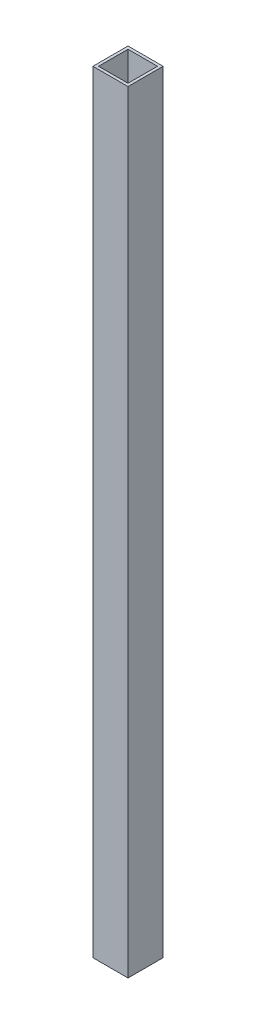
ISO-10303-21;
HEADER;
FILE_DESCRIPTION(('STEP AP214'),'2;1');
FILE_NAME('part.step','',(''),(''),'','','');
FILE_SCHEMA(('AUTOMOTIVE_DESIGN { 1 0 10303 214 1 1 1 1 }'));
ENDSEC;
DATA;
#1=APPLICATION_CONTEXT('core data for automotive mechanical design processes');
#2=APPLICATION_PROTOCOL_DEFINITION('international standard','automotive_design',2000,#1);
#3=PRODUCT_CONTEXT('',#1,'mechanical');
#4=PRODUCT('Part','Part','',(#3));
#5=PRODUCT_RELATED_PRODUCT_CATEGORY('part','',(#4));
#6=PRODUCT_DEFINITION_FORMATION('','',#4);
#7=PRODUCT_DEFINITION_CONTEXT('part definition',#1,'design');
#8=PRODUCT_DEFINITION('design','',#6,#7);
#9=PRODUCT_DEFINITION_SHAPE('','',#8);
#10=(LENGTH_UNIT() NAMED_UNIT(*) SI_UNIT(.MILLI.,.METRE.));
#11=(NAMED_UNIT(*) PLANE_ANGLE_UNIT() SI_UNIT($,.RADIAN.));
#12=(NAMED_UNIT(*) SI_UNIT($,.STERADIAN.) SOLID_ANGLE_UNIT());
#13=UNCERTAINTY_MEASURE_WITH_UNIT(LENGTH_MEASURE(1.E-05),#10,'distance_accuracy_value','');
#14=(GEOMETRIC_REPRESENTATION_CONTEXT(3) GLOBAL_UNCERTAINTY_ASSIGNED_CONTEXT((#13)) GLOBAL_UNIT_ASSIGNED_CONTEXT((#10,
#11,#12)) REPRESENTATION_CONTEXT('',''));
#15=CARTESIAN_POINT('',(0.,0.,0.));
#16=DIRECTION('',(0.,0.,1.));
#17=DIRECTION('',(1.,0.,0.));
#18=AXIS2_PLACEMENT_3D('',#15,#16,#17);
#19=CARTESIAN_POINT('',(0.,550.,0.));
#20=DIRECTION('',(0.,1.,0.));
#21=DIRECTION('',(0.,0.,1.));
#22=AXIS2_PLACEMENT_3D('',#19,#20,#21);
#23=PLANE('',#22);
#24=DIRECTION('',(0.,0.,-1.));
#25=VECTOR('',#24,1.);
#26=CARTESIAN_POINT('',(12.5,550.,12.5));
#27=LINE('',#26,#25);
#28=CARTESIAN_POINT('',(12.5,550.,12.5));
#29=VERTEX_POINT('',#28);
#30=CARTESIAN_POINT('',(12.5,550.,-12.5));
#31=VERTEX_POINT('',#30);
#32=EDGE_CURVE('E162',#29,#31,#27,.T.);
#33=ORIENTED_EDGE('',*,*,#32,.T.);
#34=DIRECTION('',(-1.,0.,0.));
#35=VECTOR('',#34,1.);
#36=CARTESIAN_POINT('',(-12.5,550.,-12.5));
#37=LINE('',#36,#35);
#38=CARTESIAN_POINT('',(-12.5,550.,-12.5));
#39=VERTEX_POINT('',#38);
#40=EDGE_CURVE('E165',#31,#39,#37,.T.);
#41=ORIENTED_EDGE('',*,*,#40,.T.);
#42=DIRECTION('',(0.,0.,1.));
#43=VECTOR('',#42,1.);
#44=CARTESIAN_POINT('',(-12.5,550.,12.5));
#45=LINE('',#44,#43);
#46=CARTESIAN_POINT('',(-12.5,550.,12.5));
#47=VERTEX_POINT('',#46);
#48=EDGE_CURVE('E168',#39,#47,#45,.T.);
#49=ORIENTED_EDGE('',*,*,#48,.T.);
#50=DIRECTION('',(1.,0.,0.));
#51=VECTOR('',#50,1.);
#52=CARTESIAN_POINT('',(-12.5,550.,12.5));
#53=LINE('',#52,#51);
#54=EDGE_CURVE('E170',#47,#29,#53,.T.);
#55=ORIENTED_EDGE('',*,*,#54,.T.);
#56=EDGE_LOOP('',(#33,#41,#49,#55));
#57=FACE_BOUND('',#56,.T.);
#58=DIRECTION('',(-1.,0.,0.));
#59=VECTOR('',#58,1.);
#60=CARTESIAN_POINT('',(0.,550.,-10.5));
#61=LINE('',#60,#59);
#62=CARTESIAN_POINT('',(10.5,550.,-10.5));
#63=VERTEX_POINT('',#62);
#64=CARTESIAN_POINT('',(-10.5,550.,-10.5));
#65=VERTEX_POINT('',#64);
#66=EDGE_CURVE('E134',#63,#65,#61,.T.);
#67=ORIENTED_EDGE('',*,*,#66,.F.);
#68=DIRECTION('',(0.,0.,-1.));
#69=VECTOR('',#68,1.);
#70=CARTESIAN_POINT('',(10.5,550.,0.));
#71=LINE('',#70,#69);
#72=CARTESIAN_POINT('',(10.5,550.,10.5));
#73=VERTEX_POINT('',#72);
#74=EDGE_CURVE('E126',#73,#63,#71,.T.);
#75=ORIENTED_EDGE('',*,*,#74,.F.);
#76=DIRECTION('',(1.,0.,0.));
#77=VECTOR('',#76,1.);
#78=CARTESIAN_POINT('',(0.,550.,10.5));
#79=LINE('',#78,#77);
#80=CARTESIAN_POINT('',(-10.5,550.,10.5));
#81=VERTEX_POINT('',#80);
#82=EDGE_CURVE('E148',#81,#73,#79,.T.);
#83=ORIENTED_EDGE('',*,*,#82,.F.);
#84=DIRECTION('',(0.,0.,1.));
#85=VECTOR('',#84,1.);
#86=CARTESIAN_POINT('',(-10.5,550.,0.));
#87=LINE('',#86,#85);
#88=EDGE_CURVE('E146',#65,#81,#87,.T.);
#89=ORIENTED_EDGE('',*,*,#88,.F.);
#90=EDGE_LOOP('',(#67,#75,#83,#89));
#91=FACE_BOUND('',#90,.T.);
#92=ADVANCED_FACE('F61',(#57,#91),#23,.T.);
#93=CARTESIAN_POINT('',(0.,0.,0.));
#94=DIRECTION('',(0.,1.,0.));
#95=DIRECTION('',(0.,0.,1.));
#96=AXIS2_PLACEMENT_3D('',#93,#94,#95);
#97=PLANE('',#96);
#98=DIRECTION('',(0.,0.,-1.));
#99=VECTOR('',#98,1.);
#100=CARTESIAN_POINT('',(12.5,0.,12.5));
#101=LINE('',#100,#99);
#102=CARTESIAN_POINT('',(12.5,0.,12.5));
#103=VERTEX_POINT('',#102);
#104=CARTESIAN_POINT('',(12.5,0.,-12.5));
#105=VERTEX_POINT('',#104);
#106=EDGE_CURVE('E142',#103,#105,#101,.T.);
#107=ORIENTED_EDGE('',*,*,#106,.F.);
#108=DIRECTION('',(1.,0.,0.));
#109=VECTOR('',#108,1.);
#110=CARTESIAN_POINT('',(-12.5,0.,12.5));
#111=LINE('',#110,#109);
#112=CARTESIAN_POINT('',(-12.5,0.,12.5));
#113=VERTEX_POINT('',#112);
#114=EDGE_CURVE('E166',#113,#103,#111,.T.);
#115=ORIENTED_EDGE('',*,*,#114,.F.);
#116=DIRECTION('',(0.,0.,1.));
#117=VECTOR('',#116,1.);
#118=CARTESIAN_POINT('',(-12.5,0.,12.5));
#119=LINE('',#118,#117);
#120=CARTESIAN_POINT('',(-12.5,0.,-12.5));
#121=VERTEX_POINT('',#120);
#122=EDGE_CURVE('E177',#121,#113,#119,.T.);
#123=ORIENTED_EDGE('',*,*,#122,.F.);
#124=DIRECTION('',(-1.,0.,0.));
#125=VECTOR('',#124,1.);
#126=CARTESIAN_POINT('',(-12.5,0.,-12.5));
#127=LINE('',#126,#125);
#128=EDGE_CURVE('E175',#105,#121,#127,.T.);
#129=ORIENTED_EDGE('',*,*,#128,.F.);
#130=EDGE_LOOP('',(#107,#115,#123,#129));
#131=FACE_BOUND('',#130,.T.);
#132=DIRECTION('',(0.,0.,-1.));
#133=VECTOR('',#132,1.);
#134=CARTESIAN_POINT('',(10.5,0.,0.));
#135=LINE('',#134,#133);
#136=CARTESIAN_POINT('',(10.5,0.,10.5));
#137=VERTEX_POINT('',#136);
#138=CARTESIAN_POINT('',(10.5,0.,-10.5));
#139=VERTEX_POINT('',#138);
#140=EDGE_CURVE('E84',#137,#139,#135,.T.);
#141=ORIENTED_EDGE('',*,*,#140,.T.);
#142=DIRECTION('',(-1.,0.,0.));
#143=VECTOR('',#142,1.);
#144=CARTESIAN_POINT('',(0.,0.,-10.5));
#145=LINE('',#144,#143);
#146=CARTESIAN_POINT('',(-10.5,0.,-10.5));
#147=VERTEX_POINT('',#146);
#148=EDGE_CURVE('E141',#139,#147,#145,.T.);
#149=ORIENTED_EDGE('',*,*,#148,.T.);
#150=DIRECTION('',(0.,0.,1.));
#151=VECTOR('',#150,1.);
#152=CARTESIAN_POINT('',(-10.5,0.,0.));
#153=LINE('',#152,#151);
#154=CARTESIAN_POINT('',(-10.5,0.,10.5));
#155=VERTEX_POINT('',#154);
#156=EDGE_CURVE('E154',#147,#155,#153,.T.);
#157=ORIENTED_EDGE('',*,*,#156,.T.);
#158=DIRECTION('',(1.,0.,0.));
#159=VECTOR('',#158,1.);
#160=CARTESIAN_POINT('',(0.,0.,10.5));
#161=LINE('',#160,#159);
#162=EDGE_CURVE('E135',#155,#137,#161,.T.);
#163=ORIENTED_EDGE('',*,*,#162,.T.);
#164=EDGE_LOOP('',(#141,#149,#157,#163));
#165=FACE_BOUND('',#164,.T.);
#166=ADVANCED_FACE('F195',(#131,#165),#97,.F.);
#167=CARTESIAN_POINT('',(12.5,550.,12.5));
#168=DIRECTION('',(-1.,0.,0.));
#169=DIRECTION('',(0.,0.,1.));
#170=AXIS2_PLACEMENT_3D('',#167,#168,#169);
#171=PLANE('',#170);
#172=ORIENTED_EDGE('',*,*,#106,.T.);
#173=DIRECTION('',(0.,-1.,0.));
#174=VECTOR('',#173,1.);
#175=CARTESIAN_POINT('',(12.5,550.,-12.5));
#176=LINE('',#175,#174);
#177=EDGE_CURVE('E12',#31,#105,#176,.T.);
#178=ORIENTED_EDGE('',*,*,#177,.F.);
#179=ORIENTED_EDGE('',*,*,#32,.F.);
#180=DIRECTION('',(0.,-1.,0.));
#181=VECTOR('',#180,1.);
#182=CARTESIAN_POINT('',(12.5,550.,12.5));
#183=LINE('',#182,#181);
#184=EDGE_CURVE('E172',#29,#103,#183,.T.);
#185=ORIENTED_EDGE('',*,*,#184,.T.);
#186=EDGE_LOOP('',(#172,#178,#179,#185));
#187=FACE_BOUND('',#186,.T.);
#188=ADVANCED_FACE('F63',(#187),#171,.F.);
#189=CARTESIAN_POINT('',(-12.5,550.,-12.5));
#190=DIRECTION('',(0.,0.,1.));
#191=DIRECTION('',(1.,0.,0.));
#192=AXIS2_PLACEMENT_3D('',#189,#190,#191);
#193=PLANE('',#192);
#194=ORIENTED_EDGE('',*,*,#128,.T.);
#195=DIRECTION('',(0.,-1.,0.));
#196=VECTOR('',#195,1.);
#197=CARTESIAN_POINT('',(-12.5,550.,-12.5));
#198=LINE('',#197,#196);
#199=EDGE_CURVE('E69',#39,#121,#198,.T.);
#200=ORIENTED_EDGE('',*,*,#199,.F.);
#201=ORIENTED_EDGE('',*,*,#40,.F.);
#202=ORIENTED_EDGE('',*,*,#177,.T.);
#203=EDGE_LOOP('',(#194,#200,#201,#202));
#204=FACE_BOUND('',#203,.T.);
#205=ADVANCED_FACE('F205',(#204),#193,.F.);
#206=CARTESIAN_POINT('',(-12.5,550.,12.5));
#207=DIRECTION('',(1.,0.,0.));
#208=DIRECTION('',(0.,0.,-1.));
#209=AXIS2_PLACEMENT_3D('',#206,#207,#208);
#210=PLANE('',#209);
#211=ORIENTED_EDGE('',*,*,#122,.T.);
#212=DIRECTION('',(0.,-1.,0.));
#213=VECTOR('',#212,1.);
#214=CARTESIAN_POINT('',(-12.5,550.,12.5));
#215=LINE('',#214,#213);
#216=EDGE_CURVE('E182',#47,#113,#215,.T.);
#217=ORIENTED_EDGE('',*,*,#216,.F.);
#218=ORIENTED_EDGE('',*,*,#48,.F.);
#219=ORIENTED_EDGE('',*,*,#199,.T.);
#220=EDGE_LOOP('',(#211,#217,#218,#219));
#221=FACE_BOUND('',#220,.T.);
#222=ADVANCED_FACE('F189',(#221),#210,.F.);
#223=CARTESIAN_POINT('',(-12.5,550.,12.5));
#224=DIRECTION('',(0.,0.,-1.));
#225=DIRECTION('',(-1.,0.,0.));
#226=AXIS2_PLACEMENT_3D('',#223,#224,#225);
#227=PLANE('',#226);
#228=ORIENTED_EDGE('',*,*,#114,.T.);
#229=ORIENTED_EDGE('',*,*,#184,.F.);
#230=ORIENTED_EDGE('',*,*,#54,.F.);
#231=ORIENTED_EDGE('',*,*,#216,.T.);
#232=EDGE_LOOP('',(#228,#229,#230,#231));
#233=FACE_BOUND('',#232,.T.);
#234=ADVANCED_FACE('F199',(#233),#227,.F.);
#235=CARTESIAN_POINT('',(10.5,550.,0.));
#236=DIRECTION('',(-1.,0.,0.));
#237=DIRECTION('',(0.,0.,1.));
#238=AXIS2_PLACEMENT_3D('',#235,#236,#237);
#239=PLANE('',#238);
#240=ORIENTED_EDGE('',*,*,#140,.F.);
#241=DIRECTION('',(0.,-1.,0.));
#242=VECTOR('',#241,1.);
#243=CARTESIAN_POINT('',(10.5,550.,10.5));
#244=LINE('',#243,#242);
#245=EDGE_CURVE('E130',#73,#137,#244,.T.);
#246=ORIENTED_EDGE('',*,*,#245,.F.);
#247=ORIENTED_EDGE('',*,*,#74,.T.);
#248=DIRECTION('',(0.,-1.,0.));
#249=VECTOR('',#248,1.);
#250=CARTESIAN_POINT('',(10.5,550.,-10.5));
#251=LINE('',#250,#249);
#252=EDGE_CURVE('E129',#63,#139,#251,.T.);
#253=ORIENTED_EDGE('',*,*,#252,.T.);
#254=EDGE_LOOP('',(#240,#246,#247,#253));
#255=FACE_BOUND('',#254,.T.);
#256=ADVANCED_FACE('F128',(#255),#239,.T.);
#257=CARTESIAN_POINT('',(0.,550.,-10.5));
#258=DIRECTION('',(0.,0.,1.));
#259=DIRECTION('',(1.,0.,0.));
#260=AXIS2_PLACEMENT_3D('',#257,#258,#259);
#261=PLANE('',#260);
#262=ORIENTED_EDGE('',*,*,#148,.F.);
#263=ORIENTED_EDGE('',*,*,#252,.F.);
#264=ORIENTED_EDGE('',*,*,#66,.T.);
#265=DIRECTION('',(0.,-1.,0.));
#266=VECTOR('',#265,1.);
#267=CARTESIAN_POINT('',(-10.5,550.,-10.5));
#268=LINE('',#267,#266);
#269=EDGE_CURVE('E143',#65,#147,#268,.T.);
#270=ORIENTED_EDGE('',*,*,#269,.T.);
#271=EDGE_LOOP('',(#262,#263,#264,#270));
#272=FACE_BOUND('',#271,.T.);
#273=ADVANCED_FACE('F138',(#272),#261,.T.);
#274=CARTESIAN_POINT('',(-10.5,550.,0.));
#275=DIRECTION('',(1.,0.,0.));
#276=DIRECTION('',(0.,0.,-1.));
#277=AXIS2_PLACEMENT_3D('',#274,#275,#276);
#278=PLANE('',#277);
#279=ORIENTED_EDGE('',*,*,#156,.F.);
#280=ORIENTED_EDGE('',*,*,#269,.F.);
#281=ORIENTED_EDGE('',*,*,#88,.T.);
#282=DIRECTION('',(0.,-1.,0.));
#283=VECTOR('',#282,1.);
#284=CARTESIAN_POINT('',(-10.5,550.,10.5));
#285=LINE('',#284,#283);
#286=EDGE_CURVE('E76',#81,#155,#285,.T.);
#287=ORIENTED_EDGE('',*,*,#286,.T.);
#288=EDGE_LOOP('',(#279,#280,#281,#287));
#289=FACE_BOUND('',#288,.T.);
#290=ADVANCED_FACE('F228',(#289),#278,.T.);
#291=CARTESIAN_POINT('',(0.,550.,10.5));
#292=DIRECTION('',(0.,0.,-1.));
#293=DIRECTION('',(-1.,0.,0.));
#294=AXIS2_PLACEMENT_3D('',#291,#292,#293);
#295=PLANE('',#294);
#296=ORIENTED_EDGE('',*,*,#162,.F.);
#297=ORIENTED_EDGE('',*,*,#286,.F.);
#298=ORIENTED_EDGE('',*,*,#82,.T.);
#299=ORIENTED_EDGE('',*,*,#245,.T.);
#300=EDGE_LOOP('',(#296,#297,#298,#299));
#301=FACE_BOUND('',#300,.T.);
#302=ADVANCED_FACE('F232',(#301),#295,.T.);
#303=CLOSED_SHELL('',(#92,#166,#188,#205,#222,#234,#256,#273,#290,#302));
#304=MANIFOLD_SOLID_BREP('B2',#303);
#305=ADVANCED_BREP_SHAPE_REPRESENTATION('',(#18,#304),#14);
#306=SHAPE_DEFINITION_REPRESENTATION(#9,#305);
ENDSEC;
END-ISO-10303-21;
